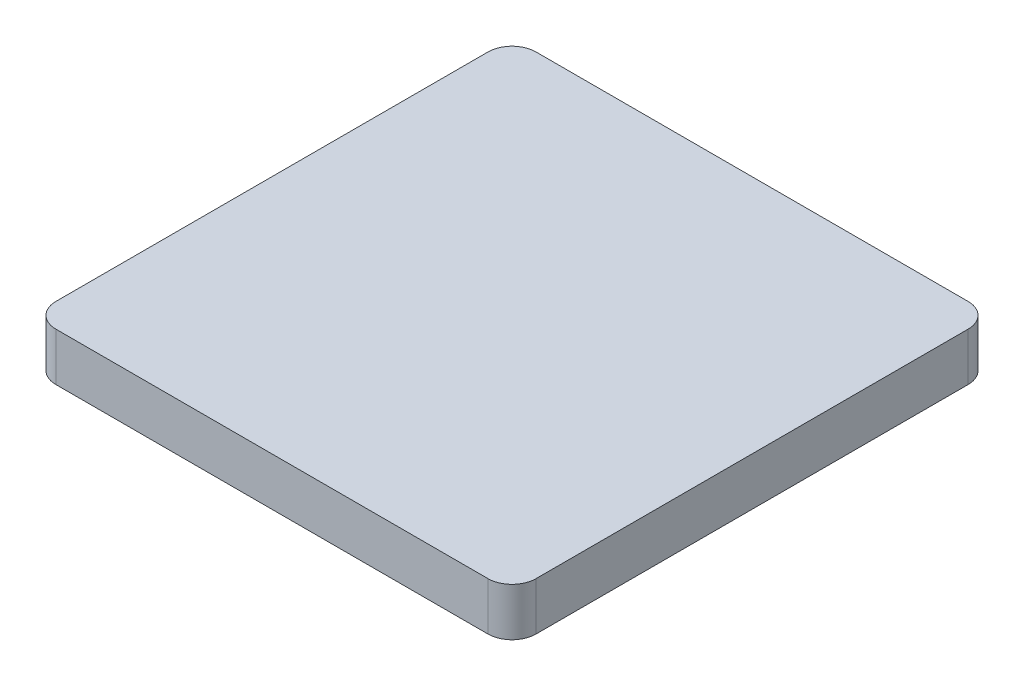
ISO-10303-21;
HEADER;
FILE_DESCRIPTION(('STEP AP214'),'2;1');
FILE_NAME('part.step','',(''),(''),'','','');
FILE_SCHEMA(('AUTOMOTIVE_DESIGN { 1 0 10303 214 1 1 1 1 }'));
ENDSEC;
DATA;
#1=APPLICATION_CONTEXT('core data for automotive mechanical design processes');
#2=APPLICATION_PROTOCOL_DEFINITION('international standard','automotive_design',2000,#1);
#3=PRODUCT_CONTEXT('',#1,'mechanical');
#4=PRODUCT('Part','Part','',(#3));
#5=PRODUCT_RELATED_PRODUCT_CATEGORY('part','',(#4));
#6=PRODUCT_DEFINITION_FORMATION('','',#4);
#7=PRODUCT_DEFINITION_CONTEXT('part definition',#1,'design');
#8=PRODUCT_DEFINITION('design','',#6,#7);
#9=PRODUCT_DEFINITION_SHAPE('','',#8);
#10=(LENGTH_UNIT() NAMED_UNIT(*) SI_UNIT(.MILLI.,.METRE.));
#11=(NAMED_UNIT(*) PLANE_ANGLE_UNIT() SI_UNIT($,.RADIAN.));
#12=(NAMED_UNIT(*) SI_UNIT($,.STERADIAN.) SOLID_ANGLE_UNIT());
#13=UNCERTAINTY_MEASURE_WITH_UNIT(LENGTH_MEASURE(1.E-05),#10,'distance_accuracy_value','');
#14=(GEOMETRIC_REPRESENTATION_CONTEXT(3) GLOBAL_UNCERTAINTY_ASSIGNED_CONTEXT((#13)) GLOBAL_UNIT_ASSIGNED_CONTEXT((#10,
#11,#12)) REPRESENTATION_CONTEXT('',''));
#15=CARTESIAN_POINT('',(0.,0.,0.));
#16=DIRECTION('',(0.,0.,1.));
#17=DIRECTION('',(1.,0.,0.));
#18=AXIS2_PLACEMENT_3D('',#15,#16,#17);
#19=CARTESIAN_POINT('',(0.,6.,0.));
#20=DIRECTION('',(1.,0.,0.));
#21=DIRECTION('',(0.,0.,-1.));
#22=AXIS2_PLACEMENT_3D('',#19,#20,#21);
#23=PLANE('',#22);
#24=DIRECTION('',(0.,0.,1.));
#25=VECTOR('',#24,1.);
#26=CARTESIAN_POINT('',(0.,6.,0.));
#27=LINE('',#26,#25);
#28=CARTESIAN_POINT('',(0.,6.,-57.));
#29=VERTEX_POINT('',#28);
#30=CARTESIAN_POINT('',(0.,6.,-3.));
#31=VERTEX_POINT('',#30);
#32=EDGE_CURVE('E120',#29,#31,#27,.T.);
#33=ORIENTED_EDGE('',*,*,#32,.F.);
#34=DIRECTION('',(0.,-1.,0.));
#35=VECTOR('',#34,1.);
#36=CARTESIAN_POINT('',(0.,6.,-57.));
#37=LINE('',#36,#35);
#38=CARTESIAN_POINT('',(0.,0.,-57.));
#39=VERTEX_POINT('',#38);
#40=EDGE_CURVE('E105',#29,#39,#37,.T.);
#41=ORIENTED_EDGE('',*,*,#40,.T.);
#42=DIRECTION('',(0.,0.,1.));
#43=VECTOR('',#42,1.);
#44=CARTESIAN_POINT('',(0.,0.,0.));
#45=LINE('',#44,#43);
#46=CARTESIAN_POINT('',(0.,0.,-3.));
#47=VERTEX_POINT('',#46);
#48=EDGE_CURVE('E117',#39,#47,#45,.T.);
#49=ORIENTED_EDGE('',*,*,#48,.T.);
#50=DIRECTION('',(0.,-1.,0.));
#51=VECTOR('',#50,1.);
#52=CARTESIAN_POINT('',(0.,6.,-3.));
#53=LINE('',#52,#51);
#54=EDGE_CURVE('E122',#47,#31,#53,.F.);
#55=ORIENTED_EDGE('',*,*,#54,.T.);
#56=EDGE_LOOP('',(#33,#41,#49,#55));
#57=FACE_BOUND('',#56,.T.);
#58=ADVANCED_FACE('F34',(#57),#23,.F.);
#59=CARTESIAN_POINT('',(0.,6.,0.));
#60=DIRECTION('',(0.,0.,-1.));
#61=DIRECTION('',(-1.,0.,0.));
#62=AXIS2_PLACEMENT_3D('',#59,#60,#61);
#63=PLANE('',#62);
#64=DIRECTION('',(1.,0.,0.));
#65=VECTOR('',#64,1.);
#66=CARTESIAN_POINT('',(0.,6.,0.));
#67=LINE('',#66,#65);
#68=CARTESIAN_POINT('',(3.,6.,0.));
#69=VERTEX_POINT('',#68);
#70=CARTESIAN_POINT('',(57.,6.,0.));
#71=VERTEX_POINT('',#70);
#72=EDGE_CURVE('E160',#69,#71,#67,.T.);
#73=ORIENTED_EDGE('',*,*,#72,.F.);
#74=DIRECTION('',(0.,-1.,0.));
#75=VECTOR('',#74,1.);
#76=CARTESIAN_POINT('',(3.,6.,0.));
#77=LINE('',#76,#75);
#78=CARTESIAN_POINT('',(3.,0.,0.));
#79=VERTEX_POINT('',#78);
#80=EDGE_CURVE('E11',#69,#79,#77,.T.);
#81=ORIENTED_EDGE('',*,*,#80,.T.);
#82=DIRECTION('',(1.,0.,0.));
#83=VECTOR('',#82,1.);
#84=CARTESIAN_POINT('',(0.,0.,0.));
#85=LINE('',#84,#83);
#86=CARTESIAN_POINT('',(57.,0.,0.));
#87=VERTEX_POINT('',#86);
#88=EDGE_CURVE('E127',#79,#87,#85,.T.);
#89=ORIENTED_EDGE('',*,*,#88,.T.);
#90=DIRECTION('',(0.,-1.,0.));
#91=VECTOR('',#90,1.);
#92=CARTESIAN_POINT('',(57.,6.,0.));
#93=LINE('',#92,#91);
#94=EDGE_CURVE('E42',#87,#71,#93,.F.);
#95=ORIENTED_EDGE('',*,*,#94,.T.);
#96=EDGE_LOOP('',(#73,#81,#89,#95));
#97=FACE_BOUND('',#96,.T.);
#98=ADVANCED_FACE('F159',(#97),#63,.F.);
#99=CARTESIAN_POINT('',(60.,6.,0.));
#100=DIRECTION('',(-1.,0.,0.));
#101=DIRECTION('',(0.,0.,1.));
#102=AXIS2_PLACEMENT_3D('',#99,#100,#101);
#103=PLANE('',#102);
#104=DIRECTION('',(0.,0.,-1.));
#105=VECTOR('',#104,1.);
#106=CARTESIAN_POINT('',(60.,0.,0.));
#107=LINE('',#106,#105);
#108=CARTESIAN_POINT('',(60.,0.,-3.));
#109=VERTEX_POINT('',#108);
#110=CARTESIAN_POINT('',(60.,0.,-57.));
#111=VERTEX_POINT('',#110);
#112=EDGE_CURVE('E130',#109,#111,#107,.T.);
#113=ORIENTED_EDGE('',*,*,#112,.T.);
#114=DIRECTION('',(0.,-1.,0.));
#115=VECTOR('',#114,1.);
#116=CARTESIAN_POINT('',(60.,6.,-57.));
#117=LINE('',#116,#115);
#118=CARTESIAN_POINT('',(60.,6.,-57.));
#119=VERTEX_POINT('',#118);
#120=EDGE_CURVE('E49',#111,#119,#117,.F.);
#121=ORIENTED_EDGE('',*,*,#120,.T.);
#122=DIRECTION('',(0.,0.,-1.));
#123=VECTOR('',#122,1.);
#124=CARTESIAN_POINT('',(60.,6.,0.));
#125=LINE('',#124,#123);
#126=CARTESIAN_POINT('',(60.,6.,-3.));
#127=VERTEX_POINT('',#126);
#128=EDGE_CURVE('E166',#127,#119,#125,.T.);
#129=ORIENTED_EDGE('',*,*,#128,.F.);
#130=DIRECTION('',(0.,-1.,0.));
#131=VECTOR('',#130,1.);
#132=CARTESIAN_POINT('',(60.,6.,-3.));
#133=LINE('',#132,#131);
#134=EDGE_CURVE('E153',#127,#109,#133,.T.);
#135=ORIENTED_EDGE('',*,*,#134,.T.);
#136=EDGE_LOOP('',(#113,#121,#129,#135));
#137=FACE_BOUND('',#136,.T.);
#138=ADVANCED_FACE('F170',(#137),#103,.F.);
#139=CARTESIAN_POINT('',(0.,6.,-60.));
#140=DIRECTION('',(0.,0.,1.));
#141=DIRECTION('',(1.,0.,0.));
#142=AXIS2_PLACEMENT_3D('',#139,#140,#141);
#143=PLANE('',#142);
#144=DIRECTION('',(-1.,0.,0.));
#145=VECTOR('',#144,1.);
#146=CARTESIAN_POINT('',(0.,0.,-60.));
#147=LINE('',#146,#145);
#148=CARTESIAN_POINT('',(57.,0.,-60.));
#149=VERTEX_POINT('',#148);
#150=CARTESIAN_POINT('',(3.,0.,-60.));
#151=VERTEX_POINT('',#150);
#152=EDGE_CURVE('E137',#149,#151,#147,.T.);
#153=ORIENTED_EDGE('',*,*,#152,.T.);
#154=DIRECTION('',(0.,-1.,0.));
#155=VECTOR('',#154,1.);
#156=CARTESIAN_POINT('',(3.,6.,-60.));
#157=LINE('',#156,#155);
#158=CARTESIAN_POINT('',(3.,6.,-60.));
#159=VERTEX_POINT('',#158);
#160=EDGE_CURVE('E106',#151,#159,#157,.F.);
#161=ORIENTED_EDGE('',*,*,#160,.T.);
#162=DIRECTION('',(-1.,0.,0.));
#163=VECTOR('',#162,1.);
#164=CARTESIAN_POINT('',(0.,6.,-60.));
#165=LINE('',#164,#163);
#166=CARTESIAN_POINT('',(57.,6.,-60.));
#167=VERTEX_POINT('',#166);
#168=EDGE_CURVE('E133',#167,#159,#165,.T.);
#169=ORIENTED_EDGE('',*,*,#168,.F.);
#170=DIRECTION('',(0.,-1.,0.));
#171=VECTOR('',#170,1.);
#172=CARTESIAN_POINT('',(57.,6.,-60.));
#173=LINE('',#172,#171);
#174=EDGE_CURVE('E111',#167,#149,#173,.T.);
#175=ORIENTED_EDGE('',*,*,#174,.T.);
#176=EDGE_LOOP('',(#153,#161,#169,#175));
#177=FACE_BOUND('',#176,.T.);
#178=ADVANCED_FACE('F177',(#177),#143,.F.);
#179=CARTESIAN_POINT('',(0.,6.,0.));
#180=DIRECTION('',(0.,-1.,0.));
#181=DIRECTION('',(0.,0.,-1.));
#182=AXIS2_PLACEMENT_3D('',#179,#180,#181);
#183=PLANE('',#182);
#184=ORIENTED_EDGE('',*,*,#168,.T.);
#185=CARTESIAN_POINT('',(3.,6.,-57.));
#186=DIRECTION('',(0.,-1.,0.));
#187=DIRECTION('',(0.,0.,-1.));
#188=AXIS2_PLACEMENT_3D('',#185,#186,#187);
#189=CIRCLE('',#188,3.);
#190=EDGE_CURVE('E151',#159,#29,#189,.F.);
#191=ORIENTED_EDGE('',*,*,#190,.T.);
#192=ORIENTED_EDGE('',*,*,#32,.T.);
#193=CARTESIAN_POINT('',(3.,6.,-3.));
#194=DIRECTION('',(0.,-1.,0.));
#195=DIRECTION('',(0.,0.,-1.));
#196=AXIS2_PLACEMENT_3D('',#193,#194,#195);
#197=CIRCLE('',#196,3.);
#198=EDGE_CURVE('E147',#31,#69,#197,.F.);
#199=ORIENTED_EDGE('',*,*,#198,.T.);
#200=ORIENTED_EDGE('',*,*,#72,.T.);
#201=CARTESIAN_POINT('',(57.,6.,-3.));
#202=DIRECTION('',(0.,-1.,0.));
#203=DIRECTION('',(0.,0.,-1.));
#204=AXIS2_PLACEMENT_3D('',#201,#202,#203);
#205=CIRCLE('',#204,3.);
#206=EDGE_CURVE('E56',#71,#127,#205,.F.);
#207=ORIENTED_EDGE('',*,*,#206,.T.);
#208=ORIENTED_EDGE('',*,*,#128,.T.);
#209=CARTESIAN_POINT('',(57.,6.,-57.));
#210=DIRECTION('',(0.,-1.,0.));
#211=DIRECTION('',(0.,0.,-1.));
#212=AXIS2_PLACEMENT_3D('',#209,#210,#211);
#213=CIRCLE('',#212,3.);
#214=EDGE_CURVE('E149',#119,#167,#213,.F.);
#215=ORIENTED_EDGE('',*,*,#214,.T.);
#216=EDGE_LOOP('',(#184,#191,#192,#199,#200,#207,#208,#215));
#217=FACE_BOUND('',#216,.T.);
#218=ADVANCED_FACE('F164',(#217),#183,.F.);
#219=CARTESIAN_POINT('',(0.,0.,0.));
#220=DIRECTION('',(0.,-1.,0.));
#221=DIRECTION('',(0.,0.,-1.));
#222=AXIS2_PLACEMENT_3D('',#219,#220,#221);
#223=PLANE('',#222);
#224=ORIENTED_EDGE('',*,*,#48,.F.);
#225=CARTESIAN_POINT('',(3.,0.,-57.));
#226=DIRECTION('',(0.,-1.,0.));
#227=DIRECTION('',(0.,0.,-1.));
#228=AXIS2_PLACEMENT_3D('',#225,#226,#227);
#229=CIRCLE('',#228,3.);
#230=EDGE_CURVE('E101',#39,#151,#229,.T.);
#231=ORIENTED_EDGE('',*,*,#230,.T.);
#232=ORIENTED_EDGE('',*,*,#152,.F.);
#233=CARTESIAN_POINT('',(57.,0.,-57.));
#234=DIRECTION('',(0.,-1.,0.));
#235=DIRECTION('',(0.,0.,-1.));
#236=AXIS2_PLACEMENT_3D('',#233,#234,#235);
#237=CIRCLE('',#236,3.);
#238=EDGE_CURVE('E112',#149,#111,#237,.T.);
#239=ORIENTED_EDGE('',*,*,#238,.T.);
#240=ORIENTED_EDGE('',*,*,#112,.F.);
#241=CARTESIAN_POINT('',(57.,0.,-3.));
#242=DIRECTION('',(0.,-1.,0.));
#243=DIRECTION('',(0.,0.,-1.));
#244=AXIS2_PLACEMENT_3D('',#241,#242,#243);
#245=CIRCLE('',#244,3.);
#246=EDGE_CURVE('E121',#109,#87,#245,.T.);
#247=ORIENTED_EDGE('',*,*,#246,.T.);
#248=ORIENTED_EDGE('',*,*,#88,.F.);
#249=CARTESIAN_POINT('',(3.,0.,-3.));
#250=DIRECTION('',(0.,-1.,0.));
#251=DIRECTION('',(0.,0.,-1.));
#252=AXIS2_PLACEMENT_3D('',#249,#250,#251);
#253=CIRCLE('',#252,3.);
#254=EDGE_CURVE('E126',#79,#47,#253,.T.);
#255=ORIENTED_EDGE('',*,*,#254,.T.);
#256=EDGE_LOOP('',(#224,#231,#232,#239,#240,#247,#248,#255));
#257=FACE_BOUND('',#256,.T.);
#258=ADVANCED_FACE('F124',(#257),#223,.T.);
#259=CARTESIAN_POINT('',(3.,6.,-57.));
#260=DIRECTION('',(0.,-1.,0.));
#261=DIRECTION('',(0.,0.,-1.));
#262=AXIS2_PLACEMENT_3D('',#259,#260,#261);
#263=CYLINDRICAL_SURFACE('',#262,3.);
#264=ORIENTED_EDGE('',*,*,#190,.F.);
#265=ORIENTED_EDGE('',*,*,#160,.F.);
#266=ORIENTED_EDGE('',*,*,#230,.F.);
#267=ORIENTED_EDGE('',*,*,#40,.F.);
#268=EDGE_LOOP('',(#264,#265,#266,#267));
#269=FACE_BOUND('',#268,.T.);
#270=ADVANCED_FACE('F104',(#269),#263,.T.);
#271=CARTESIAN_POINT('',(57.,6.,-57.));
#272=DIRECTION('',(0.,-1.,0.));
#273=DIRECTION('',(0.,0.,-1.));
#274=AXIS2_PLACEMENT_3D('',#271,#272,#273);
#275=CYLINDRICAL_SURFACE('',#274,3.);
#276=ORIENTED_EDGE('',*,*,#214,.F.);
#277=ORIENTED_EDGE('',*,*,#120,.F.);
#278=ORIENTED_EDGE('',*,*,#238,.F.);
#279=ORIENTED_EDGE('',*,*,#174,.F.);
#280=EDGE_LOOP('',(#276,#277,#278,#279));
#281=FACE_BOUND('',#280,.T.);
#282=ADVANCED_FACE('F174',(#281),#275,.T.);
#283=CARTESIAN_POINT('',(3.,6.,-3.));
#284=DIRECTION('',(0.,-1.,0.));
#285=DIRECTION('',(0.,0.,-1.));
#286=AXIS2_PLACEMENT_3D('',#283,#284,#285);
#287=CYLINDRICAL_SURFACE('',#286,3.);
#288=ORIENTED_EDGE('',*,*,#198,.F.);
#289=ORIENTED_EDGE('',*,*,#54,.F.);
#290=ORIENTED_EDGE('',*,*,#254,.F.);
#291=ORIENTED_EDGE('',*,*,#80,.F.);
#292=EDGE_LOOP('',(#288,#289,#290,#291));
#293=FACE_BOUND('',#292,.T.);
#294=ADVANCED_FACE('F180',(#293),#287,.T.);
#295=CARTESIAN_POINT('',(57.,6.,-3.));
#296=DIRECTION('',(0.,-1.,0.));
#297=DIRECTION('',(0.,0.,-1.));
#298=AXIS2_PLACEMENT_3D('',#295,#296,#297);
#299=CYLINDRICAL_SURFACE('',#298,3.);
#300=ORIENTED_EDGE('',*,*,#206,.F.);
#301=ORIENTED_EDGE('',*,*,#94,.F.);
#302=ORIENTED_EDGE('',*,*,#246,.F.);
#303=ORIENTED_EDGE('',*,*,#134,.F.);
#304=EDGE_LOOP('',(#300,#301,#302,#303));
#305=FACE_BOUND('',#304,.T.);
#306=ADVANCED_FACE('F36',(#305),#299,.T.);
#307=CLOSED_SHELL('',(#58,#98,#138,#178,#218,#258,#270,#282,#294,#306));
#308=MANIFOLD_SOLID_BREP('B2',#307);
#309=ADVANCED_BREP_SHAPE_REPRESENTATION('',(#18,#308),#14);
#310=SHAPE_DEFINITION_REPRESENTATION(#9,#309);
ENDSEC;
END-ISO-10303-21;
